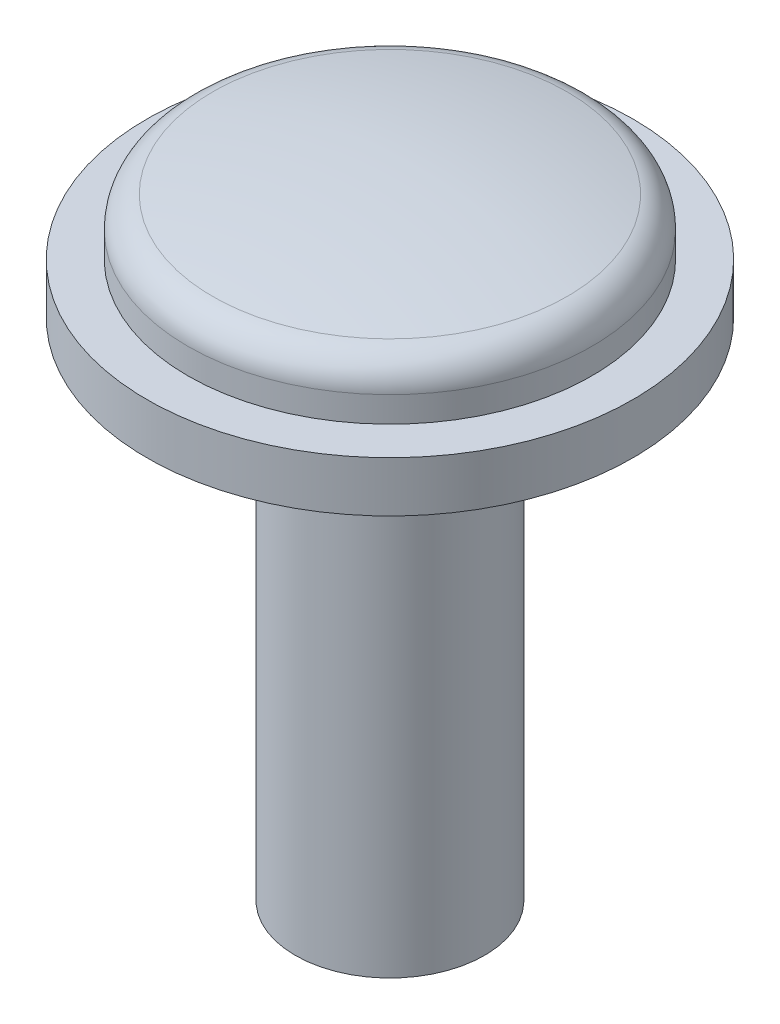
ISO-10303-21;
HEADER;
FILE_DESCRIPTION(('STEP AP214'),'2;1');
FILE_NAME('part.step','',(''),(''),'','','');
FILE_SCHEMA(('AUTOMOTIVE_DESIGN { 1 0 10303 214 1 1 1 1 }'));
ENDSEC;
DATA;
#1=APPLICATION_CONTEXT('core data for automotive mechanical design processes');
#2=APPLICATION_PROTOCOL_DEFINITION('international standard','automotive_design',2000,#1);
#3=PRODUCT_CONTEXT('',#1,'mechanical');
#4=PRODUCT('Part','Part','',(#3));
#5=PRODUCT_RELATED_PRODUCT_CATEGORY('part','',(#4));
#6=PRODUCT_DEFINITION_FORMATION('','',#4);
#7=PRODUCT_DEFINITION_CONTEXT('part definition',#1,'design');
#8=PRODUCT_DEFINITION('design','',#6,#7);
#9=PRODUCT_DEFINITION_SHAPE('','',#8);
#10=(LENGTH_UNIT() NAMED_UNIT(*) SI_UNIT(.MILLI.,.METRE.));
#11=(NAMED_UNIT(*) PLANE_ANGLE_UNIT() SI_UNIT($,.RADIAN.));
#12=(NAMED_UNIT(*) SI_UNIT($,.STERADIAN.) SOLID_ANGLE_UNIT());
#13=UNCERTAINTY_MEASURE_WITH_UNIT(LENGTH_MEASURE(1.E-05),#10,'distance_accuracy_value','');
#14=(GEOMETRIC_REPRESENTATION_CONTEXT(3) GLOBAL_UNCERTAINTY_ASSIGNED_CONTEXT((#13)) GLOBAL_UNIT_ASSIGNED_CONTEXT((#10,
#11,#12)) REPRESENTATION_CONTEXT('',''));
#15=CARTESIAN_POINT('',(0.,0.,0.));
#16=DIRECTION('',(0.,0.,1.));
#17=DIRECTION('',(1.,0.,0.));
#18=AXIS2_PLACEMENT_3D('',#15,#16,#17);
#19=CARTESIAN_POINT('',(0.,-11.,0.));
#20=DIRECTION('',(0.,0.,1.));
#21=DIRECTION('',(0.,1.,0.));
#22=AXIS2_PLACEMENT_3D('',#19,#20,#21);
#23=SPHERICAL_SURFACE('',#22,13.);
#24=CARTESIAN_POINT('',(0.,1.69311372359044,0.));
#25=DIRECTION('',(0.,-1.,0.));
#26=DIRECTION('',(0.,0.,-1.));
#27=AXIS2_PLACEMENT_3D('',#24,#25,#26);
#28=CIRCLE('',#27,2.80799999999999);
#29=CARTESIAN_POINT('',(0.,1.69311372359044,-2.80799999999999));
#30=VERTEX_POINT('',#29);
#31=EDGE_CURVE('E19',#30,#30,#28,.T.);
#32=ORIENTED_EDGE('',*,*,#31,.F.);
#33=EDGE_LOOP('',(#32));
#34=FACE_BOUND('',#33,.T.);
#35=ADVANCED_FACE('F15',(#34),#23,.T.);
#36=CARTESIAN_POINT('',(0.,1.20491704191389,0.));
#37=DIRECTION('',(0.,-1.,0.));
#38=DIRECTION('',(0.,0.,-1.));
#39=AXIS2_PLACEMENT_3D('',#36,#37,#38);
#40=TOROIDAL_SURFACE('',#39,2.7,0.5);
#41=CARTESIAN_POINT('',(0.,1.20491704191389,0.));
#42=DIRECTION('',(0.,-1.,0.));
#43=DIRECTION('',(0.,0.,-1.));
#44=AXIS2_PLACEMENT_3D('',#41,#42,#43);
#45=CIRCLE('',#44,3.2);
#46=CARTESIAN_POINT('',(0.,1.20491704191389,-3.2));
#47=VERTEX_POINT('',#46);
#48=EDGE_CURVE('E39',#47,#47,#45,.T.);
#49=ORIENTED_EDGE('',*,*,#48,.F.);
#50=EDGE_LOOP('',(#49));
#51=FACE_BOUND('',#50,.T.);
#52=ORIENTED_EDGE('',*,*,#31,.T.);
#53=EDGE_LOOP('',(#52));
#54=FACE_BOUND('',#53,.T.);
#55=ADVANCED_FACE('F48',(#51,#54),#40,.T.);
#56=CARTESIAN_POINT('',(0.,-2.70852012929174,0.));
#57=DIRECTION('',(0.,-1.,0.));
#58=DIRECTION('',(0.,0.,-1.));
#59=AXIS2_PLACEMENT_3D('',#56,#57,#58);
#60=CYLINDRICAL_SURFACE('',#59,3.2);
#61=CARTESIAN_POINT('',(0.,0.8,0.));
#62=DIRECTION('',(0.,-1.,0.));
#63=DIRECTION('',(0.,0.,-1.));
#64=AXIS2_PLACEMENT_3D('',#61,#62,#63);
#65=CIRCLE('',#64,3.2);
#66=CARTESIAN_POINT('',(0.,0.8,-3.2));
#67=VERTEX_POINT('',#66);
#68=EDGE_CURVE('E37',#67,#67,#65,.F.);
#69=ORIENTED_EDGE('',*,*,#68,.T.);
#70=EDGE_LOOP('',(#69));
#71=FACE_BOUND('',#70,.T.);
#72=ORIENTED_EDGE('',*,*,#48,.T.);
#73=EDGE_LOOP('',(#72));
#74=FACE_BOUND('',#73,.T.);
#75=ADVANCED_FACE('F51',(#71,#74),#60,.T.);
#76=CARTESIAN_POINT('',(0.,0.8,3.2));
#77=DIRECTION('',(0.,-1.,0.));
#78=DIRECTION('',(0.,0.,-1.));
#79=AXIS2_PLACEMENT_3D('',#76,#77,#78);
#80=PLANE('',#79);
#81=ORIENTED_EDGE('',*,*,#68,.F.);
#82=EDGE_LOOP('',(#81));
#83=FACE_BOUND('',#82,.T.);
#84=CARTESIAN_POINT('',(0.,0.8,0.));
#85=DIRECTION('',(0.,-1.,0.));
#86=DIRECTION('',(0.,0.,-1.));
#87=AXIS2_PLACEMENT_3D('',#84,#85,#86);
#88=CIRCLE('',#87,3.85);
#89=CARTESIAN_POINT('',(0.,0.8,-3.85));
#90=VERTEX_POINT('',#89);
#91=EDGE_CURVE('E35',#90,#90,#88,.T.);
#92=ORIENTED_EDGE('',*,*,#91,.F.);
#93=EDGE_LOOP('',(#92));
#94=FACE_BOUND('',#93,.T.);
#95=ADVANCED_FACE('F55',(#83,#94),#80,.F.);
#96=CARTESIAN_POINT('',(0.,-8.,0.));
#97=DIRECTION('',(0.,-1.,0.));
#98=DIRECTION('',(0.,0.,-1.));
#99=AXIS2_PLACEMENT_3D('',#96,#97,#98);
#100=PLANE('',#99);
#101=CARTESIAN_POINT('',(0.,-8.,0.));
#102=DIRECTION('',(0.,1.,0.));
#103=DIRECTION('',(0.,0.,1.));
#104=AXIS2_PLACEMENT_3D('',#101,#102,#103);
#105=CIRCLE('',#104,1.5);
#106=CARTESIAN_POINT('',(0.,-8.,1.5));
#107=VERTEX_POINT('',#106);
#108=EDGE_CURVE('E28',#107,#107,#105,.T.);
#109=ORIENTED_EDGE('',*,*,#108,.F.);
#110=EDGE_LOOP('',(#109));
#111=FACE_BOUND('',#110,.T.);
#112=ADVANCED_FACE('F58',(#111),#100,.T.);
#113=CARTESIAN_POINT('',(0.,-2.70852012929174,0.));
#114=DIRECTION('',(0.,-1.,0.));
#115=DIRECTION('',(0.,0.,-1.));
#116=AXIS2_PLACEMENT_3D('',#113,#114,#115);
#117=CYLINDRICAL_SURFACE('',#116,3.85);
#118=CARTESIAN_POINT('',(0.,0.,0.));
#119=DIRECTION('',(0.,-1.,0.));
#120=DIRECTION('',(0.,0.,-1.));
#121=AXIS2_PLACEMENT_3D('',#118,#119,#120);
#122=CIRCLE('',#121,3.85);
#123=CARTESIAN_POINT('',(0.,0.,-3.85));
#124=VERTEX_POINT('',#123);
#125=EDGE_CURVE('E23',#124,#124,#122,.F.);
#126=ORIENTED_EDGE('',*,*,#125,.T.);
#127=EDGE_LOOP('',(#126));
#128=FACE_BOUND('',#127,.T.);
#129=ORIENTED_EDGE('',*,*,#91,.T.);
#130=EDGE_LOOP('',(#129));
#131=FACE_BOUND('',#130,.T.);
#132=ADVANCED_FACE('F62',(#128,#131),#117,.T.);
#133=CARTESIAN_POINT('',(0.,-8.,0.));
#134=DIRECTION('',(0.,1.,0.));
#135=DIRECTION('',(0.,0.,1.));
#136=AXIS2_PLACEMENT_3D('',#133,#134,#135);
#137=CYLINDRICAL_SURFACE('',#136,1.5);
#138=ORIENTED_EDGE('',*,*,#108,.T.);
#139=EDGE_LOOP('',(#138));
#140=FACE_BOUND('',#139,.T.);
#141=CARTESIAN_POINT('',(0.,0.,0.));
#142=DIRECTION('',(0.,1.,0.));
#143=DIRECTION('',(0.,0.,1.));
#144=AXIS2_PLACEMENT_3D('',#141,#142,#143);
#145=CIRCLE('',#144,1.5);
#146=CARTESIAN_POINT('',(0.,0.,1.5));
#147=VERTEX_POINT('',#146);
#148=EDGE_CURVE('E10',#147,#147,#145,.F.);
#149=ORIENTED_EDGE('',*,*,#148,.T.);
#150=EDGE_LOOP('',(#149));
#151=FACE_BOUND('',#150,.T.);
#152=ADVANCED_FACE('F66',(#140,#151),#137,.T.);
#153=CARTESIAN_POINT('',(0.,0.,3.85));
#154=DIRECTION('',(0.,1.,0.));
#155=DIRECTION('',(0.,0.,1.));
#156=AXIS2_PLACEMENT_3D('',#153,#154,#155);
#157=PLANE('',#156);
#158=ORIENTED_EDGE('',*,*,#148,.F.);
#159=EDGE_LOOP('',(#158));
#160=FACE_BOUND('',#159,.T.);
#161=ORIENTED_EDGE('',*,*,#125,.F.);
#162=EDGE_LOOP('',(#161));
#163=FACE_BOUND('',#162,.T.);
#164=ADVANCED_FACE('F70',(#160,#163),#157,.F.);
#165=CLOSED_SHELL('',(#35,#55,#75,#95,#112,#132,#152,#164));
#166=MANIFOLD_SOLID_BREP('B1',#165);
#167=ADVANCED_BREP_SHAPE_REPRESENTATION('',(#18,#166),#14);
#168=SHAPE_DEFINITION_REPRESENTATION(#9,#167);
ENDSEC;
END-ISO-10303-21;
